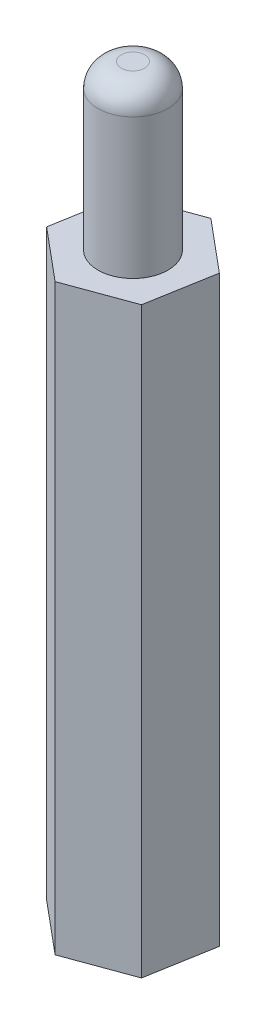
ISO-10303-21;
HEADER;
FILE_DESCRIPTION(('STEP AP214'),'2;1');
FILE_NAME('part.step','',(''),(''),'','','');
FILE_SCHEMA(('AUTOMOTIVE_DESIGN { 1 0 10303 214 1 1 1 1 }'));
ENDSEC;
DATA;
#1=APPLICATION_CONTEXT('core data for automotive mechanical design processes');
#2=APPLICATION_PROTOCOL_DEFINITION('international standard','automotive_design',2000,#1);
#3=PRODUCT_CONTEXT('',#1,'mechanical');
#4=PRODUCT('Part','Part','',(#3));
#5=PRODUCT_RELATED_PRODUCT_CATEGORY('part','',(#4));
#6=PRODUCT_DEFINITION_FORMATION('','',#4);
#7=PRODUCT_DEFINITION_CONTEXT('part definition',#1,'design');
#8=PRODUCT_DEFINITION('design','',#6,#7);
#9=PRODUCT_DEFINITION_SHAPE('','',#8);
#10=(LENGTH_UNIT() NAMED_UNIT(*) SI_UNIT(.MILLI.,.METRE.));
#11=(NAMED_UNIT(*) PLANE_ANGLE_UNIT() SI_UNIT($,.RADIAN.));
#12=(NAMED_UNIT(*) SI_UNIT($,.STERADIAN.) SOLID_ANGLE_UNIT());
#13=UNCERTAINTY_MEASURE_WITH_UNIT(LENGTH_MEASURE(1.E-05),#10,'distance_accuracy_value','');
#14=(GEOMETRIC_REPRESENTATION_CONTEXT(3) GLOBAL_UNCERTAINTY_ASSIGNED_CONTEXT((#13)) GLOBAL_UNIT_ASSIGNED_CONTEXT((#10,
#11,#12)) REPRESENTATION_CONTEXT('',''));
#15=CARTESIAN_POINT('',(0.,0.,0.));
#16=DIRECTION('',(0.,0.,1.));
#17=DIRECTION('',(1.,0.,0.));
#18=AXIS2_PLACEMENT_3D('',#15,#16,#17);
#19=CARTESIAN_POINT('',(-0.495994709202007,25.,2.84382182665809));
#20=DIRECTION('',(-0.343765976383913,0.,-0.939055351659749));
#21=DIRECTION('',(-0.939055351659749,0.,0.343765976383913));
#22=AXIS2_PLACEMENT_3D('',#19,#20,#21);
#23=PLANE('',#22);
#24=DIRECTION('',(0.939055351659749,0.,-0.343765976383913));
#25=VECTOR('',#24,1.);
#26=CARTESIAN_POINT('',(-0.495994709202007,0.,2.84382182665809));
#27=LINE('',#26,#25);
#28=CARTESIAN_POINT('',(-0.495994709202007,0.,2.84382182665809));
#29=VERTEX_POINT('',#28);
#30=CARTESIAN_POINT('',(2.21482459112157,0.,1.85145493164066));
#31=VERTEX_POINT('',#30);
#32=EDGE_CURVE('E134',#29,#31,#27,.T.);
#33=ORIENTED_EDGE('',*,*,#32,.T.);
#34=DIRECTION('',(0.,-1.,0.));
#35=VECTOR('',#34,1.);
#36=CARTESIAN_POINT('',(2.21482459112157,25.,1.85145493164066));
#37=LINE('',#36,#35);
#38=CARTESIAN_POINT('',(2.21482459112157,25.,1.85145493164066));
#39=VERTEX_POINT('',#38);
#40=EDGE_CURVE('E162',#39,#31,#37,.T.);
#41=ORIENTED_EDGE('',*,*,#40,.F.);
#42=DIRECTION('',(0.939055351659749,0.,-0.343765976383913));
#43=VECTOR('',#42,1.);
#44=CARTESIAN_POINT('',(-0.495994709202007,25.,2.84382182665809));
#45=LINE('',#44,#43);
#46=CARTESIAN_POINT('',(-0.495994709202007,25.,2.84382182665809));
#47=VERTEX_POINT('',#46);
#48=EDGE_CURVE('E151',#47,#39,#45,.T.);
#49=ORIENTED_EDGE('',*,*,#48,.F.);
#50=DIRECTION('',(0.,-1.,0.));
#51=VECTOR('',#50,1.);
#52=CARTESIAN_POINT('',(-0.495994709202007,25.,2.84382182665809));
#53=LINE('',#52,#51);
#54=EDGE_CURVE('E130',#47,#29,#53,.T.);
#55=ORIENTED_EDGE('',*,*,#54,.T.);
#56=EDGE_LOOP('',(#33,#41,#49,#55));
#57=FACE_BOUND('',#56,.T.);
#58=ADVANCED_FACE('F43',(#57),#23,.F.);
#59=CARTESIAN_POINT('',(2.21482459112157,25.,1.85145493164066));
#60=DIRECTION('',(-0.985128778289029,0.,-0.171817607324645));
#61=DIRECTION('',(-0.171817607324645,0.,0.985128778289029));
#62=AXIS2_PLACEMENT_3D('',#59,#60,#61);
#63=PLANE('',#62);
#64=DIRECTION('',(0.171817607324645,0.,-0.985128778289029));
#65=VECTOR('',#64,1.);
#66=CARTESIAN_POINT('',(2.21482459112157,0.,1.85145493164066));
#67=LINE('',#66,#65);
#68=CARTESIAN_POINT('',(2.71081930032357,0.,-0.992366895017432));
#69=VERTEX_POINT('',#68);
#70=EDGE_CURVE('E138',#31,#69,#67,.T.);
#71=ORIENTED_EDGE('',*,*,#70,.T.);
#72=DIRECTION('',(0.,-1.,0.));
#73=VECTOR('',#72,1.);
#74=CARTESIAN_POINT('',(2.71081930032357,25.,-0.992366895017432));
#75=LINE('',#74,#73);
#76=CARTESIAN_POINT('',(2.71081930032357,25.,-0.992366895017432));
#77=VERTEX_POINT('',#76);
#78=EDGE_CURVE('E158',#77,#69,#75,.T.);
#79=ORIENTED_EDGE('',*,*,#78,.F.);
#80=DIRECTION('',(0.171817607324645,0.,-0.985128778289029));
#81=VECTOR('',#80,1.);
#82=CARTESIAN_POINT('',(2.21482459112157,25.,1.85145493164066));
#83=LINE('',#82,#81);
#84=EDGE_CURVE('E99',#39,#77,#83,.T.);
#85=ORIENTED_EDGE('',*,*,#84,.F.);
#86=ORIENTED_EDGE('',*,*,#40,.T.);
#87=EDGE_LOOP('',(#71,#79,#85,#86));
#88=FACE_BOUND('',#87,.T.);
#89=ADVANCED_FACE('F211',(#88),#63,.F.);
#90=CARTESIAN_POINT('',(2.71081930032357,25.,-0.992366895017432));
#91=DIRECTION('',(-0.641362801905116,0.,0.767237744335104));
#92=DIRECTION('',(0.767237744335104,0.,0.641362801905116));
#93=AXIS2_PLACEMENT_3D('',#90,#91,#92);
#94=PLANE('',#93);
#95=DIRECTION('',(-0.767237744335104,0.,-0.641362801905116));
#96=VECTOR('',#95,1.);
#97=CARTESIAN_POINT('',(2.71081930032357,0.,-0.992366895017432));
#98=LINE('',#97,#96);
#99=CARTESIAN_POINT('',(0.495994709202006,0.,-2.84382182665809));
#100=VERTEX_POINT('',#99);
#101=EDGE_CURVE('E142',#69,#100,#98,.T.);
#102=ORIENTED_EDGE('',*,*,#101,.T.);
#103=DIRECTION('',(0.,-1.,0.));
#104=VECTOR('',#103,1.);
#105=CARTESIAN_POINT('',(0.495994709202006,25.,-2.84382182665809));
#106=LINE('',#105,#104);
#107=CARTESIAN_POINT('',(0.495994709202006,25.,-2.84382182665809));
#108=VERTEX_POINT('',#107);
#109=EDGE_CURVE('E123',#108,#100,#106,.T.);
#110=ORIENTED_EDGE('',*,*,#109,.F.);
#111=DIRECTION('',(-0.767237744335104,0.,-0.641362801905116));
#112=VECTOR('',#111,1.);
#113=CARTESIAN_POINT('',(2.71081930032357,25.,-0.992366895017432));
#114=LINE('',#113,#112);
#115=EDGE_CURVE('E112',#77,#108,#114,.T.);
#116=ORIENTED_EDGE('',*,*,#115,.F.);
#117=ORIENTED_EDGE('',*,*,#78,.T.);
#118=EDGE_LOOP('',(#102,#110,#116,#117));
#119=FACE_BOUND('',#118,.T.);
#120=ADVANCED_FACE('F215',(#119),#94,.F.);
#121=CARTESIAN_POINT('',(0.495994709202006,25.,-2.84382182665809));
#122=DIRECTION('',(0.343765976383912,0.,0.939055351659749));
#123=DIRECTION('',(0.939055351659749,0.,-0.343765976383912));
#124=AXIS2_PLACEMENT_3D('',#121,#122,#123);
#125=PLANE('',#124);
#126=DIRECTION('',(-0.939055351659749,0.,0.343765976383912));
#127=VECTOR('',#126,1.);
#128=CARTESIAN_POINT('',(0.495994709202006,0.,-2.84382182665809));
#129=LINE('',#128,#127);
#130=CARTESIAN_POINT('',(-2.21482459112157,0.,-1.85145493164066));
#131=VERTEX_POINT('',#130);
#132=EDGE_CURVE('E121',#100,#131,#129,.T.);
#133=ORIENTED_EDGE('',*,*,#132,.T.);
#134=DIRECTION('',(0.,-1.,0.));
#135=VECTOR('',#134,1.);
#136=CARTESIAN_POINT('',(-2.21482459112157,25.,-1.85145493164066));
#137=LINE('',#136,#135);
#138=CARTESIAN_POINT('',(-2.21482459112157,25.,-1.85145493164066));
#139=VERTEX_POINT('',#138);
#140=EDGE_CURVE('E118',#139,#131,#137,.T.);
#141=ORIENTED_EDGE('',*,*,#140,.F.);
#142=DIRECTION('',(-0.939055351659749,0.,0.343765976383912));
#143=VECTOR('',#142,1.);
#144=CARTESIAN_POINT('',(0.495994709202006,25.,-2.84382182665809));
#145=LINE('',#144,#143);
#146=EDGE_CURVE('E106',#108,#139,#145,.T.);
#147=ORIENTED_EDGE('',*,*,#146,.F.);
#148=ORIENTED_EDGE('',*,*,#109,.T.);
#149=EDGE_LOOP('',(#133,#141,#147,#148));
#150=FACE_BOUND('',#149,.T.);
#151=ADVANCED_FACE('F119',(#150),#125,.F.);
#152=CARTESIAN_POINT('',(-2.21482459112157,25.,-1.85145493164066));
#153=DIRECTION('',(0.985128778289029,0.,0.171817607324645));
#154=DIRECTION('',(0.171817607324645,0.,-0.985128778289029));
#155=AXIS2_PLACEMENT_3D('',#152,#153,#154);
#156=PLANE('',#155);
#157=DIRECTION('',(-0.171817607324645,0.,0.985128778289029));
#158=VECTOR('',#157,1.);
#159=CARTESIAN_POINT('',(-2.21482459112157,0.,-1.85145493164066));
#160=LINE('',#159,#158);
#161=CARTESIAN_POINT('',(-2.71081930032357,0.,0.992366895017432));
#162=VERTEX_POINT('',#161);
#163=EDGE_CURVE('E84',#131,#162,#160,.T.);
#164=ORIENTED_EDGE('',*,*,#163,.T.);
#165=DIRECTION('',(0.,-1.,0.));
#166=VECTOR('',#165,1.);
#167=CARTESIAN_POINT('',(-2.71081930032357,25.,0.992366895017432));
#168=LINE('',#167,#166);
#169=CARTESIAN_POINT('',(-2.71081930032357,25.,0.992366895017432));
#170=VERTEX_POINT('',#169);
#171=EDGE_CURVE('E124',#170,#162,#168,.T.);
#172=ORIENTED_EDGE('',*,*,#171,.F.);
#173=DIRECTION('',(-0.171817607324645,0.,0.985128778289029));
#174=VECTOR('',#173,1.);
#175=CARTESIAN_POINT('',(-2.21482459112157,25.,-1.85145493164066));
#176=LINE('',#175,#174);
#177=EDGE_CURVE('E110',#139,#170,#176,.T.);
#178=ORIENTED_EDGE('',*,*,#177,.F.);
#179=ORIENTED_EDGE('',*,*,#140,.T.);
#180=EDGE_LOOP('',(#164,#172,#178,#179));
#181=FACE_BOUND('',#180,.T.);
#182=ADVANCED_FACE('F126',(#181),#156,.F.);
#183=CARTESIAN_POINT('',(-2.71081930032357,25.,0.992366895017432));
#184=DIRECTION('',(0.641362801905116,0.,-0.767237744335104));
#185=DIRECTION('',(-0.767237744335104,0.,-0.641362801905116));
#186=AXIS2_PLACEMENT_3D('',#183,#184,#185);
#187=PLANE('',#186);
#188=DIRECTION('',(0.767237744335104,0.,0.641362801905116));
#189=VECTOR('',#188,1.);
#190=CARTESIAN_POINT('',(-2.71081930032357,0.,0.992366895017432));
#191=LINE('',#190,#189);
#192=EDGE_CURVE('E90',#162,#29,#191,.T.);
#193=ORIENTED_EDGE('',*,*,#192,.T.);
#194=ORIENTED_EDGE('',*,*,#54,.F.);
#195=DIRECTION('',(0.767237744335104,0.,0.641362801905116));
#196=VECTOR('',#195,1.);
#197=CARTESIAN_POINT('',(-2.71081930032357,25.,0.992366895017432));
#198=LINE('',#197,#196);
#199=EDGE_CURVE('E61',#170,#47,#198,.T.);
#200=ORIENTED_EDGE('',*,*,#199,.F.);
#201=ORIENTED_EDGE('',*,*,#171,.T.);
#202=EDGE_LOOP('',(#193,#194,#200,#201));
#203=FACE_BOUND('',#202,.T.);
#204=ADVANCED_FACE('F200',(#203),#187,.F.);
#205=CARTESIAN_POINT('',(0.,25.,0.));
#206=DIRECTION('',(0.,1.,0.));
#207=DIRECTION('',(0.,0.,1.));
#208=AXIS2_PLACEMENT_3D('',#205,#206,#207);
#209=PLANE('',#208);
#210=CARTESIAN_POINT('',(0.,25.,0.));
#211=DIRECTION('',(0.,1.,0.));
#212=DIRECTION('',(0.,0.,1.));
#213=AXIS2_PLACEMENT_3D('',#210,#211,#212);
#214=CIRCLE('',#213,1.5);
#215=CARTESIAN_POINT('',(0.,25.,1.5));
#216=VERTEX_POINT('',#215);
#217=EDGE_CURVE('E164',#216,#216,#214,.T.);
#218=ORIENTED_EDGE('',*,*,#217,.F.);
#219=EDGE_LOOP('',(#218));
#220=FACE_BOUND('',#219,.T.);
#221=ORIENTED_EDGE('',*,*,#48,.T.);
#222=ORIENTED_EDGE('',*,*,#84,.T.);
#223=ORIENTED_EDGE('',*,*,#115,.T.);
#224=ORIENTED_EDGE('',*,*,#146,.T.);
#225=ORIENTED_EDGE('',*,*,#177,.T.);
#226=ORIENTED_EDGE('',*,*,#199,.T.);
#227=EDGE_LOOP('',(#221,#222,#223,#224,#225,#226));
#228=FACE_BOUND('',#227,.T.);
#229=ADVANCED_FACE('F108',(#220,#228),#209,.T.);
#230=CARTESIAN_POINT('',(0.,0.,0.));
#231=DIRECTION('',(0.,1.,0.));
#232=DIRECTION('',(0.,0.,1.));
#233=AXIS2_PLACEMENT_3D('',#230,#231,#232);
#234=PLANE('',#233);
#235=CARTESIAN_POINT('',(0.,0.,0.));
#236=DIRECTION('',(0.,-1.,0.));
#237=DIRECTION('',(0.,0.,-1.));
#238=AXIS2_PLACEMENT_3D('',#235,#236,#237);
#239=CIRCLE('',#238,1.5);
#240=CARTESIAN_POINT('',(0.,0.,-1.5));
#241=VERTEX_POINT('',#240);
#242=EDGE_CURVE('E176',#241,#241,#239,.T.);
#243=ORIENTED_EDGE('',*,*,#242,.F.);
#244=EDGE_LOOP('',(#243));
#245=FACE_BOUND('',#244,.T.);
#246=ORIENTED_EDGE('',*,*,#32,.F.);
#247=ORIENTED_EDGE('',*,*,#192,.F.);
#248=ORIENTED_EDGE('',*,*,#163,.F.);
#249=ORIENTED_EDGE('',*,*,#132,.F.);
#250=ORIENTED_EDGE('',*,*,#101,.F.);
#251=ORIENTED_EDGE('',*,*,#70,.F.);
#252=EDGE_LOOP('',(#246,#247,#248,#249,#250,#251));
#253=FACE_BOUND('',#252,.T.);
#254=ADVANCED_FACE('F190',(#245,#253),#234,.F.);
#255=CARTESIAN_POINT('',(0.,32.,0.));
#256=DIRECTION('',(0.,-1.,0.));
#257=DIRECTION('',(0.,0.,-1.));
#258=AXIS2_PLACEMENT_3D('',#255,#256,#257);
#259=CYLINDRICAL_SURFACE('',#258,1.5);
#260=CARTESIAN_POINT('',(0.,31.,0.));
#261=DIRECTION('',(0.,1.,0.));
#262=DIRECTION('',(0.,0.,1.));
#263=AXIS2_PLACEMENT_3D('',#260,#261,#262);
#264=CIRCLE('',#263,1.5);
#265=CARTESIAN_POINT('',(0.,31.,1.5));
#266=VERTEX_POINT('',#265);
#267=EDGE_CURVE('E11',#266,#266,#264,.F.);
#268=ORIENTED_EDGE('',*,*,#267,.T.);
#269=EDGE_LOOP('',(#268));
#270=FACE_BOUND('',#269,.T.);
#271=ORIENTED_EDGE('',*,*,#217,.T.);
#272=EDGE_LOOP('',(#271));
#273=FACE_BOUND('',#272,.T.);
#274=ADVANCED_FACE('F193',(#270,#273),#259,.T.);
#275=CARTESIAN_POINT('',(0.,32.,0.));
#276=DIRECTION('',(0.,1.,0.));
#277=DIRECTION('',(0.,0.,1.));
#278=AXIS2_PLACEMENT_3D('',#275,#276,#277);
#279=PLANE('',#278);
#280=CARTESIAN_POINT('',(0.,32.,0.));
#281=DIRECTION('',(0.,1.,0.));
#282=DIRECTION('',(0.,0.,1.));
#283=AXIS2_PLACEMENT_3D('',#280,#281,#282);
#284=CIRCLE('',#283,0.5);
#285=CARTESIAN_POINT('',(0.,32.,0.5));
#286=VERTEX_POINT('',#285);
#287=EDGE_CURVE('E53',#286,#286,#284,.T.);
#288=ORIENTED_EDGE('',*,*,#287,.T.);
#289=EDGE_LOOP('',(#288));
#290=FACE_BOUND('',#289,.T.);
#291=ADVANCED_FACE('F262',(#290),#279,.T.);
#292=CARTESIAN_POINT('',(0.,7.,0.));
#293=DIRECTION('',(0.,-1.,0.));
#294=DIRECTION('',(0.,0.,-1.));
#295=AXIS2_PLACEMENT_3D('',#292,#293,#294);
#296=CYLINDRICAL_SURFACE('',#295,1.5);
#297=CARTESIAN_POINT('',(0.,7.,0.));
#298=DIRECTION('',(0.,-1.,0.));
#299=DIRECTION('',(0.,0.,-1.));
#300=AXIS2_PLACEMENT_3D('',#297,#298,#299);
#301=CIRCLE('',#300,1.5);
#302=CARTESIAN_POINT('',(0.,7.,-1.5));
#303=VERTEX_POINT('',#302);
#304=EDGE_CURVE('E139',#303,#303,#301,.T.);
#305=ORIENTED_EDGE('',*,*,#304,.F.);
#306=EDGE_LOOP('',(#305));
#307=FACE_BOUND('',#306,.T.);
#308=ORIENTED_EDGE('',*,*,#242,.T.);
#309=EDGE_LOOP('',(#308));
#310=FACE_BOUND('',#309,.T.);
#311=ADVANCED_FACE('F188',(#307,#310),#296,.F.);
#312=CARTESIAN_POINT('',(0.,7.,0.));
#313=DIRECTION('',(0.,-1.,0.));
#314=DIRECTION('',(0.,0.,-1.));
#315=AXIS2_PLACEMENT_3D('',#312,#313,#314);
#316=PLANE('',#315);
#317=ORIENTED_EDGE('',*,*,#304,.T.);
#318=EDGE_LOOP('',(#317));
#319=FACE_BOUND('',#318,.T.);
#320=ADVANCED_FACE('F261',(#319),#316,.T.);
#321=CARTESIAN_POINT('',(0.,31.,0.));
#322=DIRECTION('',(0.,1.,0.));
#323=DIRECTION('',(0.,0.,1.));
#324=AXIS2_PLACEMENT_3D('',#321,#322,#323);
#325=DEGENERATE_TOROIDAL_SURFACE('',#324,0.5,1.,.T.);
#326=ORIENTED_EDGE('',*,*,#267,.F.);
#327=EDGE_LOOP('',(#326));
#328=FACE_BOUND('',#327,.T.);
#329=ORIENTED_EDGE('',*,*,#287,.F.);
#330=EDGE_LOOP('',(#329));
#331=FACE_BOUND('',#330,.T.);
#332=ADVANCED_FACE('F45',(#328,#331),#325,.T.);
#333=CLOSED_SHELL('',(#58,#89,#120,#151,#182,#204,#229,#254,#274,#291,#311,#320,#332));
#334=MANIFOLD_SOLID_BREP('B2',#333);
#335=ADVANCED_BREP_SHAPE_REPRESENTATION('',(#18,#334),#14);
#336=SHAPE_DEFINITION_REPRESENTATION(#9,#335);
ENDSEC;
END-ISO-10303-21;
